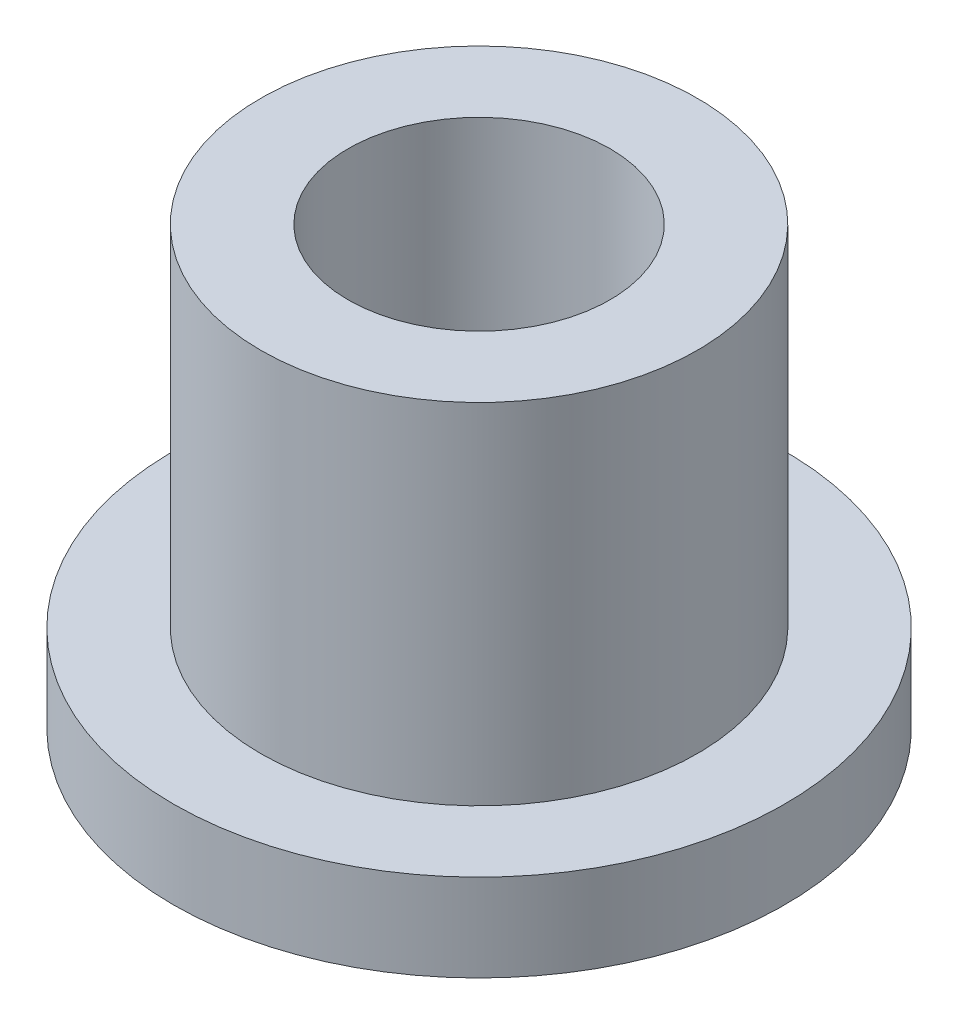
ISO-10303-21;
HEADER;
FILE_DESCRIPTION(('STEP AP214'),'2;1');
FILE_NAME('part.step','',(''),(''),'','','');
FILE_SCHEMA(('AUTOMOTIVE_DESIGN { 1 0 10303 214 1 1 1 1 }'));
ENDSEC;
DATA;
#1=APPLICATION_CONTEXT('core data for automotive mechanical design processes');
#2=APPLICATION_PROTOCOL_DEFINITION('international standard','automotive_design',2000,#1);
#3=PRODUCT_CONTEXT('',#1,'mechanical');
#4=PRODUCT('Part','Part','',(#3));
#5=PRODUCT_RELATED_PRODUCT_CATEGORY('part','',(#4));
#6=PRODUCT_DEFINITION_FORMATION('','',#4);
#7=PRODUCT_DEFINITION_CONTEXT('part definition',#1,'design');
#8=PRODUCT_DEFINITION('design','',#6,#7);
#9=PRODUCT_DEFINITION_SHAPE('','',#8);
#10=(LENGTH_UNIT() NAMED_UNIT(*) SI_UNIT(.MILLI.,.METRE.));
#11=(NAMED_UNIT(*) PLANE_ANGLE_UNIT() SI_UNIT($,.RADIAN.));
#12=(NAMED_UNIT(*) SI_UNIT($,.STERADIAN.) SOLID_ANGLE_UNIT());
#13=UNCERTAINTY_MEASURE_WITH_UNIT(LENGTH_MEASURE(1.E-05),#10,'distance_accuracy_value','');
#14=(GEOMETRIC_REPRESENTATION_CONTEXT(3) GLOBAL_UNCERTAINTY_ASSIGNED_CONTEXT((#13)) GLOBAL_UNIT_ASSIGNED_CONTEXT((#10,
#11,#12)) REPRESENTATION_CONTEXT('',''));
#15=CARTESIAN_POINT('',(0.,0.,0.));
#16=DIRECTION('',(0.,0.,1.));
#17=DIRECTION('',(1.,0.,0.));
#18=AXIS2_PLACEMENT_3D('',#15,#16,#17);
#19=CARTESIAN_POINT('',(0.,10.,0.));
#20=DIRECTION('',(0.,1.,0.));
#21=DIRECTION('',(0.,0.,1.));
#22=AXIS2_PLACEMENT_3D('',#19,#20,#21);
#23=PLANE('',#22);
#24=CARTESIAN_POINT('',(0.,10.,0.));
#25=DIRECTION('',(0.,1.,0.));
#26=DIRECTION('',(0.,0.,1.));
#27=AXIS2_PLACEMENT_3D('',#24,#25,#26);
#28=CIRCLE('',#27,5.);
#29=CARTESIAN_POINT('',(0.,10.,5.));
#30=VERTEX_POINT('',#29);
#31=EDGE_CURVE('E10',#30,#30,#28,.T.);
#32=ORIENTED_EDGE('',*,*,#31,.T.);
#33=EDGE_LOOP('',(#32));
#34=FACE_BOUND('',#33,.T.);
#35=CARTESIAN_POINT('',(0.,10.,0.));
#36=DIRECTION('',(0.,1.,0.));
#37=DIRECTION('',(0.,0.,1.));
#38=AXIS2_PLACEMENT_3D('',#35,#36,#37);
#39=CIRCLE('',#38,3.);
#40=CARTESIAN_POINT('',(0.,10.,3.));
#41=VERTEX_POINT('',#40);
#42=EDGE_CURVE('E37',#41,#41,#39,.T.);
#43=ORIENTED_EDGE('',*,*,#42,.F.);
#44=EDGE_LOOP('',(#43));
#45=FACE_BOUND('',#44,.T.);
#46=ADVANCED_FACE('F30',(#34,#45),#23,.T.);
#47=CARTESIAN_POINT('',(0.,0.,0.));
#48=DIRECTION('',(0.,1.,0.));
#49=DIRECTION('',(0.,0.,1.));
#50=AXIS2_PLACEMENT_3D('',#47,#48,#49);
#51=PLANE('',#50);
#52=CARTESIAN_POINT('',(0.,0.,0.));
#53=DIRECTION('',(0.,1.,0.));
#54=DIRECTION('',(0.,0.,1.));
#55=AXIS2_PLACEMENT_3D('',#52,#53,#54);
#56=CIRCLE('',#55,3.);
#57=CARTESIAN_POINT('',(0.,0.,3.));
#58=VERTEX_POINT('',#57);
#59=EDGE_CURVE('E41',#58,#58,#56,.T.);
#60=ORIENTED_EDGE('',*,*,#59,.T.);
#61=EDGE_LOOP('',(#60));
#62=FACE_BOUND('',#61,.T.);
#63=CARTESIAN_POINT('',(0.,0.,0.));
#64=DIRECTION('',(0.,1.,0.));
#65=DIRECTION('',(0.,0.,1.));
#66=AXIS2_PLACEMENT_3D('',#63,#64,#65);
#67=CIRCLE('',#66,7.);
#68=CARTESIAN_POINT('',(0.,0.,7.));
#69=VERTEX_POINT('',#68);
#70=EDGE_CURVE('E48',#69,#69,#67,.T.);
#71=ORIENTED_EDGE('',*,*,#70,.F.);
#72=EDGE_LOOP('',(#71));
#73=FACE_BOUND('',#72,.T.);
#74=ADVANCED_FACE('F73',(#62,#73),#51,.F.);
#75=CARTESIAN_POINT('',(0.,10.,0.));
#76=DIRECTION('',(0.,-1.,0.));
#77=DIRECTION('',(0.,0.,-1.));
#78=AXIS2_PLACEMENT_3D('',#75,#76,#77);
#79=CYLINDRICAL_SURFACE('',#78,5.);
#80=CARTESIAN_POINT('',(0.,2.,0.));
#81=DIRECTION('',(0.,1.,0.));
#82=DIRECTION('',(0.,0.,1.));
#83=AXIS2_PLACEMENT_3D('',#80,#81,#82);
#84=CIRCLE('',#83,5.);
#85=CARTESIAN_POINT('',(0.,2.,5.));
#86=VERTEX_POINT('',#85);
#87=EDGE_CURVE('E51',#86,#86,#84,.T.);
#88=ORIENTED_EDGE('',*,*,#87,.T.);
#89=EDGE_LOOP('',(#88));
#90=FACE_BOUND('',#89,.T.);
#91=ORIENTED_EDGE('',*,*,#31,.F.);
#92=EDGE_LOOP('',(#91));
#93=FACE_BOUND('',#92,.T.);
#94=ADVANCED_FACE('F32',(#90,#93),#79,.T.);
#95=CARTESIAN_POINT('',(0.,10.,0.));
#96=DIRECTION('',(0.,-1.,0.));
#97=DIRECTION('',(0.,0.,-1.));
#98=AXIS2_PLACEMENT_3D('',#95,#96,#97);
#99=CYLINDRICAL_SURFACE('',#98,3.);
#100=ORIENTED_EDGE('',*,*,#42,.T.);
#101=EDGE_LOOP('',(#100));
#102=FACE_BOUND('',#101,.T.);
#103=ORIENTED_EDGE('',*,*,#59,.F.);
#104=EDGE_LOOP('',(#103));
#105=FACE_BOUND('',#104,.T.);
#106=ADVANCED_FACE('F62',(#102,#105),#99,.F.);
#107=CARTESIAN_POINT('',(0.,2.,0.));
#108=DIRECTION('',(0.,1.,0.));
#109=DIRECTION('',(0.,0.,1.));
#110=AXIS2_PLACEMENT_3D('',#107,#108,#109);
#111=PLANE('',#110);
#112=CARTESIAN_POINT('',(0.,2.,0.));
#113=DIRECTION('',(0.,1.,0.));
#114=DIRECTION('',(0.,0.,1.));
#115=AXIS2_PLACEMENT_3D('',#112,#113,#114);
#116=CIRCLE('',#115,7.);
#117=CARTESIAN_POINT('',(0.,2.,7.));
#118=VERTEX_POINT('',#117);
#119=EDGE_CURVE('E46',#118,#118,#116,.T.);
#120=ORIENTED_EDGE('',*,*,#119,.T.);
#121=EDGE_LOOP('',(#120));
#122=FACE_BOUND('',#121,.T.);
#123=ORIENTED_EDGE('',*,*,#87,.F.);
#124=EDGE_LOOP('',(#123));
#125=FACE_BOUND('',#124,.T.);
#126=ADVANCED_FACE('F59',(#122,#125),#111,.T.);
#127=CARTESIAN_POINT('',(0.,2.,0.));
#128=DIRECTION('',(0.,-1.,0.));
#129=DIRECTION('',(0.,0.,-1.));
#130=AXIS2_PLACEMENT_3D('',#127,#128,#129);
#131=CYLINDRICAL_SURFACE('',#130,7.);
#132=ORIENTED_EDGE('',*,*,#119,.F.);
#133=EDGE_LOOP('',(#132));
#134=FACE_BOUND('',#133,.T.);
#135=ORIENTED_EDGE('',*,*,#70,.T.);
#136=EDGE_LOOP('',(#135));
#137=FACE_BOUND('',#136,.T.);
#138=ADVANCED_FACE('F61',(#134,#137),#131,.T.);
#139=CLOSED_SHELL('',(#46,#74,#94,#106,#126,#138));
#140=MANIFOLD_SOLID_BREP('B2',#139);
#141=ADVANCED_BREP_SHAPE_REPRESENTATION('',(#18,#140),#14);
#142=SHAPE_DEFINITION_REPRESENTATION(#9,#141);
ENDSEC;
END-ISO-10303-21;
